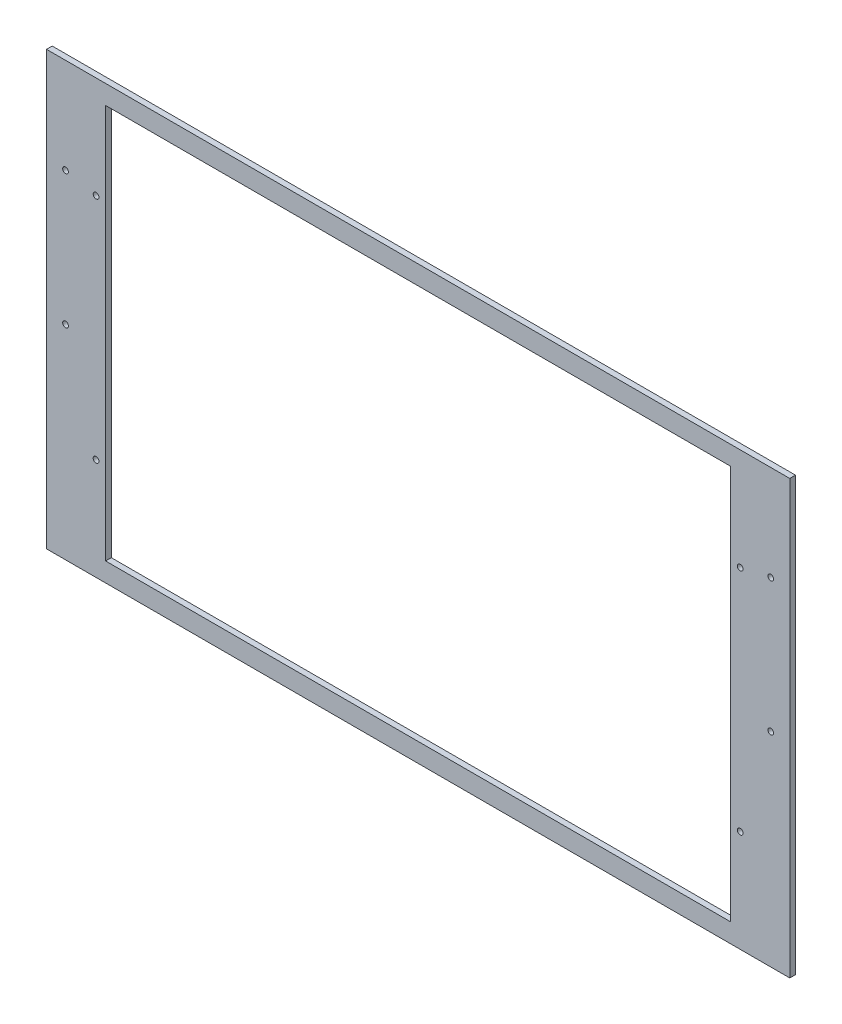
ISO-10303-21;
HEADER;
FILE_DESCRIPTION(('STEP AP214'),'2;1');
FILE_NAME('part.step','',(''),(''),'','','');
FILE_SCHEMA(('AUTOMOTIVE_DESIGN { 1 0 10303 214 1 1 1 1 }'));
ENDSEC;
DATA;
#1=APPLICATION_CONTEXT('core data for automotive mechanical design processes');
#2=APPLICATION_PROTOCOL_DEFINITION('international standard','automotive_design',2000,#1);
#3=PRODUCT_CONTEXT('',#1,'mechanical');
#4=PRODUCT('Part','Part','',(#3));
#5=PRODUCT_RELATED_PRODUCT_CATEGORY('part','',(#4));
#6=PRODUCT_DEFINITION_FORMATION('','',#4);
#7=PRODUCT_DEFINITION_CONTEXT('part definition',#1,'design');
#8=PRODUCT_DEFINITION('design','',#6,#7);
#9=PRODUCT_DEFINITION_SHAPE('','',#8);
#10=(LENGTH_UNIT() NAMED_UNIT(*) SI_UNIT(.MILLI.,.METRE.));
#11=(NAMED_UNIT(*) PLANE_ANGLE_UNIT() SI_UNIT($,.RADIAN.));
#12=(NAMED_UNIT(*) SI_UNIT($,.STERADIAN.) SOLID_ANGLE_UNIT());
#13=UNCERTAINTY_MEASURE_WITH_UNIT(LENGTH_MEASURE(1.E-05),#10,'distance_accuracy_value','');
#14=(GEOMETRIC_REPRESENTATION_CONTEXT(3) GLOBAL_UNCERTAINTY_ASSIGNED_CONTEXT((#13)) GLOBAL_UNIT_ASSIGNED_CONTEXT((#10,
#11,#12)) REPRESENTATION_CONTEXT('',''));
#15=CARTESIAN_POINT('',(0.,0.,0.));
#16=DIRECTION('',(0.,0.,1.));
#17=DIRECTION('',(1.,0.,0.));
#18=AXIS2_PLACEMENT_3D('',#15,#16,#17);
#19=CARTESIAN_POINT('',(0.,0.,3.));
#20=DIRECTION('',(0.,0.,1.));
#21=DIRECTION('',(1.,0.,0.));
#22=AXIS2_PLACEMENT_3D('',#19,#20,#21);
#23=PLANE('',#22);
#24=CARTESIAN_POINT('',(169.,60.,3.));
#25=DIRECTION('',(0.,0.,1.));
#26=DIRECTION('',(-1.,0.,0.));
#27=AXIS2_PLACEMENT_3D('',#24,#25,#26);
#28=CIRCLE('',#27,1.5);
#29=CARTESIAN_POINT('',(167.5,60.,3.));
#30=VERTEX_POINT('',#29);
#31=EDGE_CURVE('E271',#30,#30,#28,.T.);
#32=ORIENTED_EDGE('',*,*,#31,.F.);
#33=EDGE_LOOP('',(#32));
#34=FACE_BOUND('',#33,.T.);
#35=CARTESIAN_POINT('',(169.,-60.,3.));
#36=DIRECTION('',(0.,0.,1.));
#37=DIRECTION('',(1.,0.,0.));
#38=AXIS2_PLACEMENT_3D('',#35,#36,#37);
#39=CIRCLE('',#38,1.5);
#40=CARTESIAN_POINT('',(170.5,-60.,3.));
#41=VERTEX_POINT('',#40);
#42=EDGE_CURVE('E263',#41,#41,#39,.T.);
#43=ORIENTED_EDGE('',*,*,#42,.F.);
#44=EDGE_LOOP('',(#43));
#45=FACE_BOUND('',#44,.T.);
#46=CARTESIAN_POINT('',(-169.,-60.,3.));
#47=DIRECTION('',(0.,0.,1.));
#48=DIRECTION('',(-1.,0.,0.));
#49=AXIS2_PLACEMENT_3D('',#46,#47,#48);
#50=CIRCLE('',#49,1.5);
#51=CARTESIAN_POINT('',(-170.5,-60.,3.));
#52=VERTEX_POINT('',#51);
#53=EDGE_CURVE('E256',#52,#52,#50,.T.);
#54=ORIENTED_EDGE('',*,*,#53,.F.);
#55=EDGE_LOOP('',(#54));
#56=FACE_BOUND('',#55,.T.);
#57=CARTESIAN_POINT('',(-169.,60.,3.));
#58=DIRECTION('',(0.,0.,1.));
#59=DIRECTION('',(1.,0.,0.));
#60=AXIS2_PLACEMENT_3D('',#57,#58,#59);
#61=CIRCLE('',#60,1.5);
#62=CARTESIAN_POINT('',(-167.5,60.,3.));
#63=VERTEX_POINT('',#62);
#64=EDGE_CURVE('E260',#63,#63,#61,.T.);
#65=ORIENTED_EDGE('',*,*,#64,.F.);
#66=EDGE_LOOP('',(#65));
#67=FACE_BOUND('',#66,.T.);
#68=CARTESIAN_POINT('',(185.,63.5,3.));
#69=DIRECTION('',(0.,0.,1.));
#70=DIRECTION('',(-1.,0.,0.));
#71=AXIS2_PLACEMENT_3D('',#68,#69,#70);
#72=CIRCLE('',#71,1.5);
#73=CARTESIAN_POINT('',(183.5,63.5,3.));
#74=VERTEX_POINT('',#73);
#75=EDGE_CURVE('E277',#74,#74,#72,.T.);
#76=ORIENTED_EDGE('',*,*,#75,.F.);
#77=EDGE_LOOP('',(#76));
#78=FACE_BOUND('',#77,.T.);
#79=CARTESIAN_POINT('',(185.,-6.49999999999996,3.));
#80=DIRECTION('',(0.,0.,1.));
#81=DIRECTION('',(1.,0.,0.));
#82=AXIS2_PLACEMENT_3D('',#79,#80,#81);
#83=CIRCLE('',#82,1.5);
#84=CARTESIAN_POINT('',(186.5,-6.49999999999996,3.));
#85=VERTEX_POINT('',#84);
#86=EDGE_CURVE('E290',#85,#85,#83,.T.);
#87=ORIENTED_EDGE('',*,*,#86,.F.);
#88=EDGE_LOOP('',(#87));
#89=FACE_BOUND('',#88,.T.);
#90=CARTESIAN_POINT('',(-185.,-6.50000000000001,3.));
#91=DIRECTION('',(0.,0.,1.));
#92=DIRECTION('',(-1.,0.,0.));
#93=AXIS2_PLACEMENT_3D('',#90,#91,#92);
#94=CIRCLE('',#93,1.5);
#95=CARTESIAN_POINT('',(-186.5,-6.50000000000001,3.));
#96=VERTEX_POINT('',#95);
#97=EDGE_CURVE('E284',#96,#96,#94,.T.);
#98=ORIENTED_EDGE('',*,*,#97,.F.);
#99=EDGE_LOOP('',(#98));
#100=FACE_BOUND('',#99,.T.);
#101=CARTESIAN_POINT('',(-185.,63.5,3.));
#102=DIRECTION('',(0.,0.,1.));
#103=DIRECTION('',(1.,0.,0.));
#104=AXIS2_PLACEMENT_3D('',#101,#102,#103);
#105=CIRCLE('',#104,1.5);
#106=CARTESIAN_POINT('',(-183.5,63.5,3.));
#107=VERTEX_POINT('',#106);
#108=EDGE_CURVE('E283',#107,#107,#105,.T.);
#109=ORIENTED_EDGE('',*,*,#108,.F.);
#110=EDGE_LOOP('',(#109));
#111=FACE_BOUND('',#110,.T.);
#112=DIRECTION('',(0.,-1.,0.));
#113=VECTOR('',#112,1.);
#114=CARTESIAN_POINT('',(-195.,113.5,3.));
#115=LINE('',#114,#113);
#116=CARTESIAN_POINT('',(-195.,113.5,3.));
#117=VERTEX_POINT('',#116);
#118=CARTESIAN_POINT('',(-195.,-113.5,3.));
#119=VERTEX_POINT('',#118);
#120=EDGE_CURVE('E137',#117,#119,#115,.T.);
#121=ORIENTED_EDGE('',*,*,#120,.T.);
#122=DIRECTION('',(1.,0.,0.));
#123=VECTOR('',#122,1.);
#124=CARTESIAN_POINT('',(-195.,-113.5,3.));
#125=LINE('',#124,#123);
#126=CARTESIAN_POINT('',(195.,-113.5,3.));
#127=VERTEX_POINT('',#126);
#128=EDGE_CURVE('E140',#119,#127,#125,.T.);
#129=ORIENTED_EDGE('',*,*,#128,.T.);
#130=DIRECTION('',(0.,1.,0.));
#131=VECTOR('',#130,1.);
#132=CARTESIAN_POINT('',(195.,113.5,3.));
#133=LINE('',#132,#131);
#134=CARTESIAN_POINT('',(195.,113.5,3.));
#135=VERTEX_POINT('',#134);
#136=EDGE_CURVE('E143',#127,#135,#133,.T.);
#137=ORIENTED_EDGE('',*,*,#136,.T.);
#138=DIRECTION('',(-1.,0.,0.));
#139=VECTOR('',#138,1.);
#140=CARTESIAN_POINT('',(-195.,113.5,3.));
#141=LINE('',#140,#139);
#142=EDGE_CURVE('E145',#135,#117,#141,.T.);
#143=ORIENTED_EDGE('',*,*,#142,.T.);
#144=EDGE_LOOP('',(#121,#129,#137,#143));
#145=FACE_BOUND('',#144,.T.);
#146=DIRECTION('',(1.,0.,0.));
#147=VECTOR('',#146,1.);
#148=CARTESIAN_POINT('',(164.,-103.5,3.));
#149=LINE('',#148,#147);
#150=CARTESIAN_POINT('',(-164.,-103.5,3.));
#151=VERTEX_POINT('',#150);
#152=CARTESIAN_POINT('',(164.,-103.5,3.));
#153=VERTEX_POINT('',#152);
#154=EDGE_CURVE('E107',#151,#153,#149,.T.);
#155=ORIENTED_EDGE('',*,*,#154,.F.);
#156=DIRECTION('',(0.,-1.,0.));
#157=VECTOR('',#156,1.);
#158=CARTESIAN_POINT('',(-164.,-103.5,3.));
#159=LINE('',#158,#157);
#160=CARTESIAN_POINT('',(-164.,103.5,3.));
#161=VERTEX_POINT('',#160);
#162=EDGE_CURVE('E99',#161,#151,#159,.T.);
#163=ORIENTED_EDGE('',*,*,#162,.F.);
#164=DIRECTION('',(-1.,0.,0.));
#165=VECTOR('',#164,1.);
#166=CARTESIAN_POINT('',(164.,103.5,3.));
#167=LINE('',#166,#165);
#168=CARTESIAN_POINT('',(164.,103.5,3.));
#169=VERTEX_POINT('',#168);
#170=EDGE_CURVE('E121',#169,#161,#167,.T.);
#171=ORIENTED_EDGE('',*,*,#170,.F.);
#172=DIRECTION('',(0.,1.,0.));
#173=VECTOR('',#172,1.);
#174=CARTESIAN_POINT('',(164.,-103.5,3.));
#175=LINE('',#174,#173);
#176=EDGE_CURVE('E119',#153,#169,#175,.T.);
#177=ORIENTED_EDGE('',*,*,#176,.F.);
#178=EDGE_LOOP('',(#155,#163,#171,#177));
#179=FACE_BOUND('',#178,.T.);
#180=ADVANCED_FACE('F34',(#34,#45,#56,#67,#78,#89,#100,#111,#145,#179),#23,.T.);
#181=CARTESIAN_POINT('',(0.,0.,0.));
#182=DIRECTION('',(0.,0.,1.));
#183=DIRECTION('',(1.,0.,0.));
#184=AXIS2_PLACEMENT_3D('',#181,#182,#183);
#185=PLANE('',#184);
#186=CARTESIAN_POINT('',(169.,60.,0.));
#187=DIRECTION('',(0.,0.,1.));
#188=DIRECTION('',(-1.,0.,0.));
#189=AXIS2_PLACEMENT_3D('',#186,#187,#188);
#190=CIRCLE('',#189,1.5);
#191=CARTESIAN_POINT('',(167.5,60.,0.));
#192=VERTEX_POINT('',#191);
#193=EDGE_CURVE('E268',#192,#192,#190,.T.);
#194=ORIENTED_EDGE('',*,*,#193,.T.);
#195=EDGE_LOOP('',(#194));
#196=FACE_BOUND('',#195,.T.);
#197=CARTESIAN_POINT('',(169.,-60.,0.));
#198=DIRECTION('',(0.,0.,1.));
#199=DIRECTION('',(1.,0.,0.));
#200=AXIS2_PLACEMENT_3D('',#197,#198,#199);
#201=CIRCLE('',#200,1.5);
#202=CARTESIAN_POINT('',(170.5,-60.,0.));
#203=VERTEX_POINT('',#202);
#204=EDGE_CURVE('E258',#203,#203,#201,.T.);
#205=ORIENTED_EDGE('',*,*,#204,.T.);
#206=EDGE_LOOP('',(#205));
#207=FACE_BOUND('',#206,.T.);
#208=CARTESIAN_POINT('',(-169.,-60.,0.));
#209=DIRECTION('',(0.,0.,1.));
#210=DIRECTION('',(-1.,0.,0.));
#211=AXIS2_PLACEMENT_3D('',#208,#209,#210);
#212=CIRCLE('',#211,1.5);
#213=CARTESIAN_POINT('',(-170.5,-60.,0.));
#214=VERTEX_POINT('',#213);
#215=EDGE_CURVE('E253',#214,#214,#212,.T.);
#216=ORIENTED_EDGE('',*,*,#215,.T.);
#217=EDGE_LOOP('',(#216));
#218=FACE_BOUND('',#217,.T.);
#219=CARTESIAN_POINT('',(-169.,60.,0.));
#220=DIRECTION('',(0.,0.,1.));
#221=DIRECTION('',(1.,0.,0.));
#222=AXIS2_PLACEMENT_3D('',#219,#220,#221);
#223=CIRCLE('',#222,1.5);
#224=CARTESIAN_POINT('',(-167.5,60.,0.));
#225=VERTEX_POINT('',#224);
#226=EDGE_CURVE('E274',#225,#225,#223,.T.);
#227=ORIENTED_EDGE('',*,*,#226,.T.);
#228=EDGE_LOOP('',(#227));
#229=FACE_BOUND('',#228,.T.);
#230=CARTESIAN_POINT('',(185.,63.5,0.));
#231=DIRECTION('',(0.,0.,1.));
#232=DIRECTION('',(-1.,0.,0.));
#233=AXIS2_PLACEMENT_3D('',#230,#231,#232);
#234=CIRCLE('',#233,1.5);
#235=CARTESIAN_POINT('',(183.5,63.5,0.));
#236=VERTEX_POINT('',#235);
#237=EDGE_CURVE('E293',#236,#236,#234,.T.);
#238=ORIENTED_EDGE('',*,*,#237,.T.);
#239=EDGE_LOOP('',(#238));
#240=FACE_BOUND('',#239,.T.);
#241=CARTESIAN_POINT('',(185.,-6.49999999999996,0.));
#242=DIRECTION('',(0.,0.,1.));
#243=DIRECTION('',(1.,0.,0.));
#244=AXIS2_PLACEMENT_3D('',#241,#242,#243);
#245=CIRCLE('',#244,1.5);
#246=CARTESIAN_POINT('',(186.5,-6.49999999999996,0.));
#247=VERTEX_POINT('',#246);
#248=EDGE_CURVE('E287',#247,#247,#245,.T.);
#249=ORIENTED_EDGE('',*,*,#248,.T.);
#250=EDGE_LOOP('',(#249));
#251=FACE_BOUND('',#250,.T.);
#252=CARTESIAN_POINT('',(-185.,-6.50000000000001,0.));
#253=DIRECTION('',(0.,0.,1.));
#254=DIRECTION('',(-1.,0.,0.));
#255=AXIS2_PLACEMENT_3D('',#252,#253,#254);
#256=CIRCLE('',#255,1.5);
#257=CARTESIAN_POINT('',(-186.5,-6.50000000000001,0.));
#258=VERTEX_POINT('',#257);
#259=EDGE_CURVE('E280',#258,#258,#256,.T.);
#260=ORIENTED_EDGE('',*,*,#259,.T.);
#261=EDGE_LOOP('',(#260));
#262=FACE_BOUND('',#261,.T.);
#263=CARTESIAN_POINT('',(-185.,63.5,0.));
#264=DIRECTION('',(0.,0.,1.));
#265=DIRECTION('',(1.,0.,0.));
#266=AXIS2_PLACEMENT_3D('',#263,#264,#265);
#267=CIRCLE('',#266,1.5);
#268=CARTESIAN_POINT('',(-183.5,63.5,0.));
#269=VERTEX_POINT('',#268);
#270=EDGE_CURVE('E127',#269,#269,#267,.T.);
#271=ORIENTED_EDGE('',*,*,#270,.T.);
#272=EDGE_LOOP('',(#271));
#273=FACE_BOUND('',#272,.T.);
#274=DIRECTION('',(0.,-1.,0.));
#275=VECTOR('',#274,1.);
#276=CARTESIAN_POINT('',(-195.,113.5,0.));
#277=LINE('',#276,#275);
#278=CARTESIAN_POINT('',(-195.,113.5,0.));
#279=VERTEX_POINT('',#278);
#280=CARTESIAN_POINT('',(-195.,-113.5,0.));
#281=VERTEX_POINT('',#280);
#282=EDGE_CURVE('E115',#279,#281,#277,.T.);
#283=ORIENTED_EDGE('',*,*,#282,.F.);
#284=DIRECTION('',(-1.,0.,0.));
#285=VECTOR('',#284,1.);
#286=CARTESIAN_POINT('',(-195.,113.5,0.));
#287=LINE('',#286,#285);
#288=CARTESIAN_POINT('',(195.,113.5,0.));
#289=VERTEX_POINT('',#288);
#290=EDGE_CURVE('E141',#289,#279,#287,.T.);
#291=ORIENTED_EDGE('',*,*,#290,.F.);
#292=DIRECTION('',(0.,1.,0.));
#293=VECTOR('',#292,1.);
#294=CARTESIAN_POINT('',(195.,113.5,0.));
#295=LINE('',#294,#293);
#296=CARTESIAN_POINT('',(195.,-113.5,0.));
#297=VERTEX_POINT('',#296);
#298=EDGE_CURVE('E152',#297,#289,#295,.T.);
#299=ORIENTED_EDGE('',*,*,#298,.F.);
#300=DIRECTION('',(1.,0.,0.));
#301=VECTOR('',#300,1.);
#302=CARTESIAN_POINT('',(-195.,-113.5,0.));
#303=LINE('',#302,#301);
#304=EDGE_CURVE('E150',#281,#297,#303,.T.);
#305=ORIENTED_EDGE('',*,*,#304,.F.);
#306=EDGE_LOOP('',(#283,#291,#299,#305));
#307=FACE_BOUND('',#306,.T.);
#308=DIRECTION('',(0.,-1.,0.));
#309=VECTOR('',#308,1.);
#310=CARTESIAN_POINT('',(-164.,-103.5,0.));
#311=LINE('',#310,#309);
#312=CARTESIAN_POINT('',(-164.,103.5,0.));
#313=VERTEX_POINT('',#312);
#314=CARTESIAN_POINT('',(-164.,-103.5,0.));
#315=VERTEX_POINT('',#314);
#316=EDGE_CURVE('E57',#313,#315,#311,.T.);
#317=ORIENTED_EDGE('',*,*,#316,.T.);
#318=DIRECTION('',(1.,0.,0.));
#319=VECTOR('',#318,1.);
#320=CARTESIAN_POINT('',(164.,-103.5,0.));
#321=LINE('',#320,#319);
#322=CARTESIAN_POINT('',(164.,-103.5,0.));
#323=VERTEX_POINT('',#322);
#324=EDGE_CURVE('E114',#315,#323,#321,.T.);
#325=ORIENTED_EDGE('',*,*,#324,.T.);
#326=DIRECTION('',(0.,1.,0.));
#327=VECTOR('',#326,1.);
#328=CARTESIAN_POINT('',(164.,-103.5,0.));
#329=LINE('',#328,#327);
#330=CARTESIAN_POINT('',(164.,103.5,0.));
#331=VERTEX_POINT('',#330);
#332=EDGE_CURVE('E129',#323,#331,#329,.T.);
#333=ORIENTED_EDGE('',*,*,#332,.T.);
#334=DIRECTION('',(-1.,0.,0.));
#335=VECTOR('',#334,1.);
#336=CARTESIAN_POINT('',(164.,103.5,0.));
#337=LINE('',#336,#335);
#338=EDGE_CURVE('E108',#331,#313,#337,.T.);
#339=ORIENTED_EDGE('',*,*,#338,.T.);
#340=EDGE_LOOP('',(#317,#325,#333,#339));
#341=FACE_BOUND('',#340,.T.);
#342=ADVANCED_FACE('F170',(#196,#207,#218,#229,#240,#251,#262,#273,#307,#341),#185,.F.);
#343=CARTESIAN_POINT('',(-195.,113.5,3.));
#344=DIRECTION('',(1.,0.,0.));
#345=DIRECTION('',(0.,0.,-1.));
#346=AXIS2_PLACEMENT_3D('',#343,#344,#345);
#347=PLANE('',#346);
#348=ORIENTED_EDGE('',*,*,#282,.T.);
#349=DIRECTION('',(0.,0.,-1.));
#350=VECTOR('',#349,1.);
#351=CARTESIAN_POINT('',(-195.,-113.5,3.));
#352=LINE('',#351,#350);
#353=EDGE_CURVE('E11',#119,#281,#352,.T.);
#354=ORIENTED_EDGE('',*,*,#353,.F.);
#355=ORIENTED_EDGE('',*,*,#120,.F.);
#356=DIRECTION('',(0.,0.,-1.));
#357=VECTOR('',#356,1.);
#358=CARTESIAN_POINT('',(-195.,113.5,3.));
#359=LINE('',#358,#357);
#360=EDGE_CURVE('E147',#117,#279,#359,.T.);
#361=ORIENTED_EDGE('',*,*,#360,.T.);
#362=EDGE_LOOP('',(#348,#354,#355,#361));
#363=FACE_BOUND('',#362,.T.);
#364=ADVANCED_FACE('F36',(#363),#347,.F.);
#365=CARTESIAN_POINT('',(-195.,-113.5,3.));
#366=DIRECTION('',(0.,1.,0.));
#367=DIRECTION('',(0.,0.,1.));
#368=AXIS2_PLACEMENT_3D('',#365,#366,#367);
#369=PLANE('',#368);
#370=ORIENTED_EDGE('',*,*,#304,.T.);
#371=DIRECTION('',(0.,0.,-1.));
#372=VECTOR('',#371,1.);
#373=CARTESIAN_POINT('',(195.,-113.5,3.));
#374=LINE('',#373,#372);
#375=EDGE_CURVE('E42',#127,#297,#374,.T.);
#376=ORIENTED_EDGE('',*,*,#375,.F.);
#377=ORIENTED_EDGE('',*,*,#128,.F.);
#378=ORIENTED_EDGE('',*,*,#353,.T.);
#379=EDGE_LOOP('',(#370,#376,#377,#378));
#380=FACE_BOUND('',#379,.T.);
#381=ADVANCED_FACE('F180',(#380),#369,.F.);
#382=CARTESIAN_POINT('',(195.,113.5,3.));
#383=DIRECTION('',(-1.,0.,0.));
#384=DIRECTION('',(0.,0.,1.));
#385=AXIS2_PLACEMENT_3D('',#382,#383,#384);
#386=PLANE('',#385);
#387=ORIENTED_EDGE('',*,*,#298,.T.);
#388=DIRECTION('',(0.,0.,-1.));
#389=VECTOR('',#388,1.);
#390=CARTESIAN_POINT('',(195.,113.5,3.));
#391=LINE('',#390,#389);
#392=EDGE_CURVE('E157',#135,#289,#391,.T.);
#393=ORIENTED_EDGE('',*,*,#392,.F.);
#394=ORIENTED_EDGE('',*,*,#136,.F.);
#395=ORIENTED_EDGE('',*,*,#375,.T.);
#396=EDGE_LOOP('',(#387,#393,#394,#395));
#397=FACE_BOUND('',#396,.T.);
#398=ADVANCED_FACE('F164',(#397),#386,.F.);
#399=CARTESIAN_POINT('',(-195.,113.5,3.));
#400=DIRECTION('',(0.,-1.,0.));
#401=DIRECTION('',(0.,0.,-1.));
#402=AXIS2_PLACEMENT_3D('',#399,#400,#401);
#403=PLANE('',#402);
#404=ORIENTED_EDGE('',*,*,#290,.T.);
#405=ORIENTED_EDGE('',*,*,#360,.F.);
#406=ORIENTED_EDGE('',*,*,#142,.F.);
#407=ORIENTED_EDGE('',*,*,#392,.T.);
#408=EDGE_LOOP('',(#404,#405,#406,#407));
#409=FACE_BOUND('',#408,.T.);
#410=ADVANCED_FACE('F174',(#409),#403,.F.);
#411=CARTESIAN_POINT('',(-164.,-103.5,3.));
#412=DIRECTION('',(1.,0.,0.));
#413=DIRECTION('',(0.,0.,-1.));
#414=AXIS2_PLACEMENT_3D('',#411,#412,#413);
#415=PLANE('',#414);
#416=ORIENTED_EDGE('',*,*,#316,.F.);
#417=DIRECTION('',(0.,0.,-1.));
#418=VECTOR('',#417,1.);
#419=CARTESIAN_POINT('',(-164.,103.5,3.));
#420=LINE('',#419,#418);
#421=EDGE_CURVE('E103',#161,#313,#420,.T.);
#422=ORIENTED_EDGE('',*,*,#421,.F.);
#423=ORIENTED_EDGE('',*,*,#162,.T.);
#424=DIRECTION('',(0.,0.,-1.));
#425=VECTOR('',#424,1.);
#426=CARTESIAN_POINT('',(-164.,-103.5,3.));
#427=LINE('',#426,#425);
#428=EDGE_CURVE('E102',#151,#315,#427,.T.);
#429=ORIENTED_EDGE('',*,*,#428,.T.);
#430=EDGE_LOOP('',(#416,#422,#423,#429));
#431=FACE_BOUND('',#430,.T.);
#432=ADVANCED_FACE('F101',(#431),#415,.T.);
#433=CARTESIAN_POINT('',(164.,-103.5,3.));
#434=DIRECTION('',(0.,1.,0.));
#435=DIRECTION('',(-1.,0.,0.));
#436=AXIS2_PLACEMENT_3D('',#433,#434,#435);
#437=PLANE('',#436);
#438=ORIENTED_EDGE('',*,*,#324,.F.);
#439=ORIENTED_EDGE('',*,*,#428,.F.);
#440=ORIENTED_EDGE('',*,*,#154,.T.);
#441=DIRECTION('',(0.,0.,-1.));
#442=VECTOR('',#441,1.);
#443=CARTESIAN_POINT('',(164.,-103.5,3.));
#444=LINE('',#443,#442);
#445=EDGE_CURVE('E116',#153,#323,#444,.T.);
#446=ORIENTED_EDGE('',*,*,#445,.T.);
#447=EDGE_LOOP('',(#438,#439,#440,#446));
#448=FACE_BOUND('',#447,.T.);
#449=ADVANCED_FACE('F111',(#448),#437,.T.);
#450=CARTESIAN_POINT('',(164.,-103.5,3.));
#451=DIRECTION('',(-1.,0.,0.));
#452=DIRECTION('',(0.,0.,1.));
#453=AXIS2_PLACEMENT_3D('',#450,#451,#452);
#454=PLANE('',#453);
#455=ORIENTED_EDGE('',*,*,#332,.F.);
#456=ORIENTED_EDGE('',*,*,#445,.F.);
#457=ORIENTED_EDGE('',*,*,#176,.T.);
#458=DIRECTION('',(0.,0.,-1.));
#459=VECTOR('',#458,1.);
#460=CARTESIAN_POINT('',(164.,103.5,3.));
#461=LINE('',#460,#459);
#462=EDGE_CURVE('E49',#169,#331,#461,.T.);
#463=ORIENTED_EDGE('',*,*,#462,.T.);
#464=EDGE_LOOP('',(#455,#456,#457,#463));
#465=FACE_BOUND('',#464,.T.);
#466=ADVANCED_FACE('F207',(#465),#454,.T.);
#467=CARTESIAN_POINT('',(164.,103.5,3.));
#468=DIRECTION('',(0.,-1.,0.));
#469=DIRECTION('',(1.,0.,0.));
#470=AXIS2_PLACEMENT_3D('',#467,#468,#469);
#471=PLANE('',#470);
#472=ORIENTED_EDGE('',*,*,#338,.F.);
#473=ORIENTED_EDGE('',*,*,#462,.F.);
#474=ORIENTED_EDGE('',*,*,#170,.T.);
#475=ORIENTED_EDGE('',*,*,#421,.T.);
#476=EDGE_LOOP('',(#472,#473,#474,#475));
#477=FACE_BOUND('',#476,.T.);
#478=ADVANCED_FACE('F211',(#477),#471,.T.);
#479=CARTESIAN_POINT('',(-185.,63.5,0.));
#480=DIRECTION('',(0.,0.,1.));
#481=DIRECTION('',(1.,0.,0.));
#482=AXIS2_PLACEMENT_3D('',#479,#480,#481);
#483=CYLINDRICAL_SURFACE('',#482,1.5);
#484=ORIENTED_EDGE('',*,*,#270,.F.);
#485=EDGE_LOOP('',(#484));
#486=FACE_BOUND('',#485,.T.);
#487=ORIENTED_EDGE('',*,*,#108,.T.);
#488=EDGE_LOOP('',(#487));
#489=FACE_BOUND('',#488,.T.);
#490=ADVANCED_FACE('F217',(#486,#489),#483,.F.);
#491=CARTESIAN_POINT('',(-185.,-6.50000000000001,0.));
#492=DIRECTION('',(0.,0.,1.));
#493=DIRECTION('',(1.,0.,0.));
#494=AXIS2_PLACEMENT_3D('',#491,#492,#493);
#495=CYLINDRICAL_SURFACE('',#494,1.5);
#496=ORIENTED_EDGE('',*,*,#259,.F.);
#497=EDGE_LOOP('',(#496));
#498=FACE_BOUND('',#497,.T.);
#499=ORIENTED_EDGE('',*,*,#97,.T.);
#500=EDGE_LOOP('',(#499));
#501=FACE_BOUND('',#500,.T.);
#502=ADVANCED_FACE('F220',(#498,#501),#495,.F.);
#503=CARTESIAN_POINT('',(185.,-6.49999999999996,0.));
#504=DIRECTION('',(0.,0.,1.));
#505=DIRECTION('',(1.,0.,0.));
#506=AXIS2_PLACEMENT_3D('',#503,#504,#505);
#507=CYLINDRICAL_SURFACE('',#506,1.5);
#508=ORIENTED_EDGE('',*,*,#248,.F.);
#509=EDGE_LOOP('',(#508));
#510=FACE_BOUND('',#509,.T.);
#511=ORIENTED_EDGE('',*,*,#86,.T.);
#512=EDGE_LOOP('',(#511));
#513=FACE_BOUND('',#512,.T.);
#514=ADVANCED_FACE('F226',(#510,#513),#507,.F.);
#515=CARTESIAN_POINT('',(185.,63.5,0.));
#516=DIRECTION('',(0.,0.,1.));
#517=DIRECTION('',(1.,0.,0.));
#518=AXIS2_PLACEMENT_3D('',#515,#516,#517);
#519=CYLINDRICAL_SURFACE('',#518,1.5);
#520=ORIENTED_EDGE('',*,*,#237,.F.);
#521=EDGE_LOOP('',(#520));
#522=FACE_BOUND('',#521,.T.);
#523=ORIENTED_EDGE('',*,*,#75,.T.);
#524=EDGE_LOOP('',(#523));
#525=FACE_BOUND('',#524,.T.);
#526=ADVANCED_FACE('F222',(#522,#525),#519,.F.);
#527=CARTESIAN_POINT('',(-169.,60.,0.));
#528=DIRECTION('',(0.,0.,1.));
#529=DIRECTION('',(1.,0.,0.));
#530=AXIS2_PLACEMENT_3D('',#527,#528,#529);
#531=CYLINDRICAL_SURFACE('',#530,1.5);
#532=ORIENTED_EDGE('',*,*,#226,.F.);
#533=EDGE_LOOP('',(#532));
#534=FACE_BOUND('',#533,.T.);
#535=ORIENTED_EDGE('',*,*,#64,.T.);
#536=EDGE_LOOP('',(#535));
#537=FACE_BOUND('',#536,.T.);
#538=ADVANCED_FACE('F225',(#534,#537),#531,.F.);
#539=CARTESIAN_POINT('',(-169.,-60.,0.));
#540=DIRECTION('',(0.,0.,1.));
#541=DIRECTION('',(1.,0.,0.));
#542=AXIS2_PLACEMENT_3D('',#539,#540,#541);
#543=CYLINDRICAL_SURFACE('',#542,1.5);
#544=ORIENTED_EDGE('',*,*,#215,.F.);
#545=EDGE_LOOP('',(#544));
#546=FACE_BOUND('',#545,.T.);
#547=ORIENTED_EDGE('',*,*,#53,.T.);
#548=EDGE_LOOP('',(#547));
#549=FACE_BOUND('',#548,.T.);
#550=ADVANCED_FACE('F236',(#546,#549),#543,.F.);
#551=CARTESIAN_POINT('',(169.,-60.,0.));
#552=DIRECTION('',(0.,0.,1.));
#553=DIRECTION('',(1.,0.,0.));
#554=AXIS2_PLACEMENT_3D('',#551,#552,#553);
#555=CYLINDRICAL_SURFACE('',#554,1.5);
#556=ORIENTED_EDGE('',*,*,#204,.F.);
#557=EDGE_LOOP('',(#556));
#558=FACE_BOUND('',#557,.T.);
#559=ORIENTED_EDGE('',*,*,#42,.T.);
#560=EDGE_LOOP('',(#559));
#561=FACE_BOUND('',#560,.T.);
#562=ADVANCED_FACE('F241',(#558,#561),#555,.F.);
#563=CARTESIAN_POINT('',(169.,60.,0.));
#564=DIRECTION('',(0.,0.,1.));
#565=DIRECTION('',(1.,0.,0.));
#566=AXIS2_PLACEMENT_3D('',#563,#564,#565);
#567=CYLINDRICAL_SURFACE('',#566,1.5);
#568=ORIENTED_EDGE('',*,*,#193,.F.);
#569=EDGE_LOOP('',(#568));
#570=FACE_BOUND('',#569,.T.);
#571=ORIENTED_EDGE('',*,*,#31,.T.);
#572=EDGE_LOOP('',(#571));
#573=FACE_BOUND('',#572,.T.);
#574=ADVANCED_FACE('F238',(#570,#573),#567,.F.);
#575=CLOSED_SHELL('',(#180,#342,#364,#381,#398,#410,#432,#449,#466,#478,#490,#502,#514,#526,
#538,#550,#562,#574));
#576=MANIFOLD_SOLID_BREP('B2',#575);
#577=ADVANCED_BREP_SHAPE_REPRESENTATION('',(#18,#576),#14);
#578=SHAPE_DEFINITION_REPRESENTATION(#9,#577);
ENDSEC;
END-ISO-10303-21;
